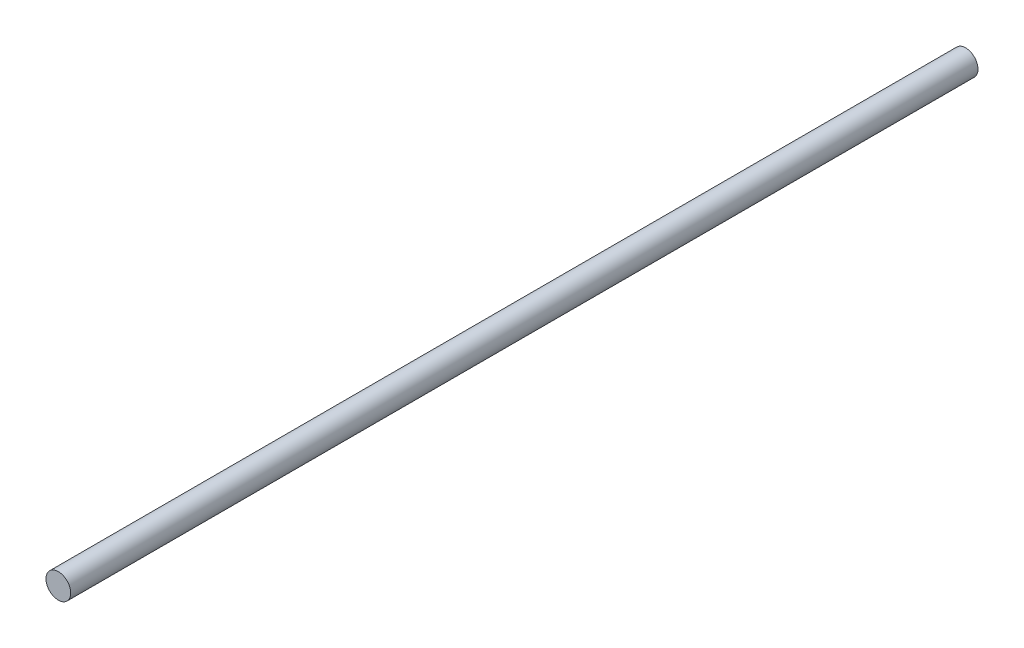
ISO-10303-21;
HEADER;
FILE_DESCRIPTION(('STEP AP214'),'2;1');
FILE_NAME('part.step','',(''),(''),'','','');
FILE_SCHEMA(('AUTOMOTIVE_DESIGN { 1 0 10303 214 1 1 1 1 }'));
ENDSEC;
DATA;
#1=APPLICATION_CONTEXT('core data for automotive mechanical design processes');
#2=APPLICATION_PROTOCOL_DEFINITION('international standard','automotive_design',2000,#1);
#3=PRODUCT_CONTEXT('',#1,'mechanical');
#4=PRODUCT('Part','Part','',(#3));
#5=PRODUCT_RELATED_PRODUCT_CATEGORY('part','',(#4));
#6=PRODUCT_DEFINITION_FORMATION('','',#4);
#7=PRODUCT_DEFINITION_CONTEXT('part definition',#1,'design');
#8=PRODUCT_DEFINITION('design','',#6,#7);
#9=PRODUCT_DEFINITION_SHAPE('','',#8);
#10=(LENGTH_UNIT() NAMED_UNIT(*) SI_UNIT(.MILLI.,.METRE.));
#11=(NAMED_UNIT(*) PLANE_ANGLE_UNIT() SI_UNIT($,.RADIAN.));
#12=(NAMED_UNIT(*) SI_UNIT($,.STERADIAN.) SOLID_ANGLE_UNIT());
#13=UNCERTAINTY_MEASURE_WITH_UNIT(LENGTH_MEASURE(1.E-05),#10,'distance_accuracy_value','');
#14=(GEOMETRIC_REPRESENTATION_CONTEXT(3) GLOBAL_UNCERTAINTY_ASSIGNED_CONTEXT((#13)) GLOBAL_UNIT_ASSIGNED_CONTEXT((#10,
#11,#12)) REPRESENTATION_CONTEXT('',''));
#15=CARTESIAN_POINT('',(0.,0.,0.));
#16=DIRECTION('',(0.,0.,1.));
#17=DIRECTION('',(1.,0.,0.));
#18=AXIS2_PLACEMENT_3D('',#15,#16,#17);
#19=CARTESIAN_POINT('',(0.,0.,220.));
#20=DIRECTION('',(0.,0.,-1.));
#21=DIRECTION('',(-1.,0.,0.));
#22=AXIS2_PLACEMENT_3D('',#19,#20,#21);
#23=CYLINDRICAL_SURFACE('',#22,3.);
#24=CARTESIAN_POINT('',(0.,0.,220.));
#25=DIRECTION('',(0.,0.,1.));
#26=DIRECTION('',(1.,0.,0.));
#27=AXIS2_PLACEMENT_3D('',#24,#25,#26);
#28=CIRCLE('',#27,3.);
#29=CARTESIAN_POINT('',(3.,0.,220.));
#30=VERTEX_POINT('',#29);
#31=EDGE_CURVE('E10',#30,#30,#28,.T.);
#32=ORIENTED_EDGE('',*,*,#31,.F.);
#33=EDGE_LOOP('',(#32));
#34=FACE_BOUND('',#33,.T.);
#35=CARTESIAN_POINT('',(0.,0.,0.));
#36=DIRECTION('',(0.,0.,1.));
#37=DIRECTION('',(1.,0.,0.));
#38=AXIS2_PLACEMENT_3D('',#35,#36,#37);
#39=CIRCLE('',#38,3.);
#40=CARTESIAN_POINT('',(3.,0.,0.));
#41=VERTEX_POINT('',#40);
#42=EDGE_CURVE('E31',#41,#41,#39,.T.);
#43=ORIENTED_EDGE('',*,*,#42,.T.);
#44=EDGE_LOOP('',(#43));
#45=FACE_BOUND('',#44,.T.);
#46=ADVANCED_FACE('F28',(#34,#45),#23,.T.);
#47=CARTESIAN_POINT('',(0.,0.,220.));
#48=DIRECTION('',(0.,0.,1.));
#49=DIRECTION('',(1.,0.,0.));
#50=AXIS2_PLACEMENT_3D('',#47,#48,#49);
#51=PLANE('',#50);
#52=ORIENTED_EDGE('',*,*,#31,.T.);
#53=EDGE_LOOP('',(#52));
#54=FACE_BOUND('',#53,.T.);
#55=ADVANCED_FACE('F43',(#54),#51,.T.);
#56=CARTESIAN_POINT('',(0.,0.,0.));
#57=DIRECTION('',(0.,0.,1.));
#58=DIRECTION('',(1.,0.,0.));
#59=AXIS2_PLACEMENT_3D('',#56,#57,#58);
#60=PLANE('',#59);
#61=ORIENTED_EDGE('',*,*,#42,.F.);
#62=EDGE_LOOP('',(#61));
#63=FACE_BOUND('',#62,.T.);
#64=ADVANCED_FACE('F41',(#63),#60,.F.);
#65=CLOSED_SHELL('',(#46,#55,#64));
#66=MANIFOLD_SOLID_BREP('B2',#65);
#67=ADVANCED_BREP_SHAPE_REPRESENTATION('',(#18,#66),#14);
#68=SHAPE_DEFINITION_REPRESENTATION(#9,#67);
ENDSEC;
END-ISO-10303-21;
